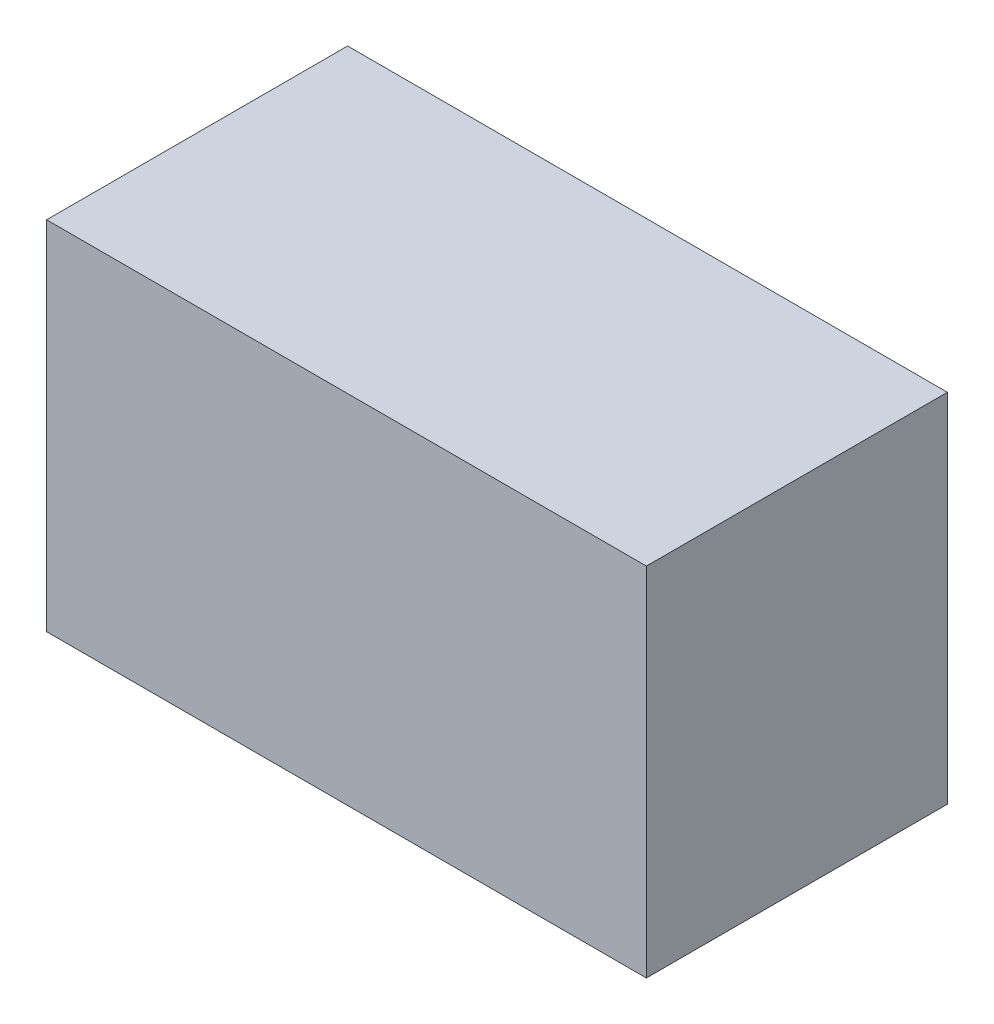
ISO-10303-21;
HEADER;
FILE_DESCRIPTION(('STEP AP214'),'2;1');
FILE_NAME('part.step','',(''),(''),'','','');
FILE_SCHEMA(('AUTOMOTIVE_DESIGN { 1 0 10303 214 1 1 1 1 }'));
ENDSEC;
DATA;
#1=APPLICATION_CONTEXT('core data for automotive mechanical design processes');
#2=APPLICATION_PROTOCOL_DEFINITION('international standard','automotive_design',2000,#1);
#3=PRODUCT_CONTEXT('',#1,'mechanical');
#4=PRODUCT('Part','Part','',(#3));
#5=PRODUCT_RELATED_PRODUCT_CATEGORY('part','',(#4));
#6=PRODUCT_DEFINITION_FORMATION('','',#4);
#7=PRODUCT_DEFINITION_CONTEXT('part definition',#1,'design');
#8=PRODUCT_DEFINITION('design','',#6,#7);
#9=PRODUCT_DEFINITION_SHAPE('','',#8);
#10=(LENGTH_UNIT() NAMED_UNIT(*) SI_UNIT(.MILLI.,.METRE.));
#11=(NAMED_UNIT(*) PLANE_ANGLE_UNIT() SI_UNIT($,.RADIAN.));
#12=(NAMED_UNIT(*) SI_UNIT($,.STERADIAN.) SOLID_ANGLE_UNIT());
#13=UNCERTAINTY_MEASURE_WITH_UNIT(LENGTH_MEASURE(1.E-05),#10,'distance_accuracy_value','');
#14=(GEOMETRIC_REPRESENTATION_CONTEXT(3) GLOBAL_UNCERTAINTY_ASSIGNED_CONTEXT((#13)) GLOBAL_UNIT_ASSIGNED_CONTEXT((#10,
#11,#12)) REPRESENTATION_CONTEXT('',''));
#15=CARTESIAN_POINT('',(0.,0.,0.));
#16=DIRECTION('',(0.,0.,1.));
#17=DIRECTION('',(1.,0.,0.));
#18=AXIS2_PLACEMENT_3D('',#15,#16,#17);
#19=CARTESIAN_POINT('',(-1.34500393883586,0.799989165164845,0.));
#20=DIRECTION('',(-1.,1.19248806385031E-08,0.));
#21=DIRECTION('',(-1.19248806385031E-08,-1.,0.));
#22=AXIS2_PLACEMENT_3D('',#19,#20,#21);
#23=PLANE('',#22);
#24=DIRECTION('',(-1.19248806876995E-08,-1.,0.));
#25=VECTOR('',#24,1.);
#26=CARTESIAN_POINT('',(-1.34500393883586,0.799989165164845,0.));
#27=LINE('',#26,#25);
#28=CARTESIAN_POINT('',(-1.34500393883586,0.799989165164845,0.));
#29=VERTEX_POINT('',#28);
#30=CARTESIAN_POINT('',(-1.34500395791538,-0.799986420772655,0.));
#31=VERTEX_POINT('',#30);
#32=EDGE_CURVE('E11',#29,#31,#27,.T.);
#33=ORIENTED_EDGE('',*,*,#32,.T.);
#34=DIRECTION('',(0.,0.,1.));
#35=VECTOR('',#34,1.);
#36=CARTESIAN_POINT('',(-1.34500395791538,-0.799986420772655,0.));
#37=LINE('',#36,#35);
#38=CARTESIAN_POINT('',(-1.34500395791538,-0.799986420772655,1.34999978542328));
#39=VERTEX_POINT('',#38);
#40=EDGE_CURVE('E88',#31,#39,#37,.T.);
#41=ORIENTED_EDGE('',*,*,#40,.T.);
#42=DIRECTION('',(-1.19248806876995E-08,-1.,0.));
#43=VECTOR('',#42,1.);
#44=CARTESIAN_POINT('',(-1.34500393883586,0.799989165164845,1.34999978542328));
#45=LINE('',#44,#43);
#46=CARTESIAN_POINT('',(-1.34500393883586,0.799989165164845,1.34999978542328));
#47=VERTEX_POINT('',#46);
#48=EDGE_CURVE('E83',#47,#39,#45,.T.);
#49=ORIENTED_EDGE('',*,*,#48,.F.);
#50=DIRECTION('',(0.,0.,1.));
#51=VECTOR('',#50,1.);
#52=CARTESIAN_POINT('',(-1.34500393883586,0.799989165164869,0.));
#53=LINE('',#52,#51);
#54=EDGE_CURVE('E72',#29,#47,#53,.T.);
#55=ORIENTED_EDGE('',*,*,#54,.F.);
#56=EDGE_LOOP('',(#33,#41,#49,#55));
#57=FACE_BOUND('',#56,.T.);
#58=ADVANCED_FACE('F17',(#57),#23,.T.);
#59=CARTESIAN_POINT('',(-1.34500395791538,-0.799986420772655,0.));
#60=DIRECTION('',(-1.19248806385031E-08,-1.,0.));
#61=DIRECTION('',(1.,-1.19248806385031E-08,0.));
#62=AXIS2_PLACEMENT_3D('',#59,#60,#61);
#63=PLANE('',#62);
#64=DIRECTION('',(1.,-1.19248806520858E-08,0.));
#65=VECTOR('',#64,1.);
#66=CARTESIAN_POINT('',(-1.34500395791538,-0.799986420772655,0.));
#67=LINE('',#66,#65);
#68=CARTESIAN_POINT('',(1.34499848349087,-0.79998645285059,0.));
#69=VERTEX_POINT('',#68);
#70=EDGE_CURVE('E24',#31,#69,#67,.T.);
#71=ORIENTED_EDGE('',*,*,#70,.T.);
#72=DIRECTION('',(0.,0.,1.));
#73=VECTOR('',#72,1.);
#74=CARTESIAN_POINT('',(1.34499848349087,-0.799986452850613,0.));
#75=LINE('',#74,#73);
#76=CARTESIAN_POINT('',(1.34499848349087,-0.79998645285059,1.34999978542328));
#77=VERTEX_POINT('',#76);
#78=EDGE_CURVE('E85',#69,#77,#75,.T.);
#79=ORIENTED_EDGE('',*,*,#78,.T.);
#80=DIRECTION('',(1.,-1.19248806520858E-08,0.));
#81=VECTOR('',#80,1.);
#82=CARTESIAN_POINT('',(-1.34500395791538,-0.799986420772655,1.34999978542328));
#83=LINE('',#82,#81);
#84=EDGE_CURVE('E66',#39,#77,#83,.T.);
#85=ORIENTED_EDGE('',*,*,#84,.F.);
#86=ORIENTED_EDGE('',*,*,#40,.F.);
#87=EDGE_LOOP('',(#71,#79,#85,#86));
#88=FACE_BOUND('',#87,.T.);
#89=ADVANCED_FACE('F89',(#88),#63,.T.);
#90=CARTESIAN_POINT('',(1.34499848349087,-0.79998645285059,0.));
#91=DIRECTION('',(1.,-1.19248806385031E-08,0.));
#92=DIRECTION('',(1.19248806385031E-08,1.,0.));
#93=AXIS2_PLACEMENT_3D('',#90,#91,#92);
#94=PLANE('',#93);
#95=DIRECTION('',(1.19248806876995E-08,1.,0.));
#96=VECTOR('',#95,1.);
#97=CARTESIAN_POINT('',(1.34499848349087,-0.79998645285059,0.));
#98=LINE('',#97,#96);
#99=CARTESIAN_POINT('',(1.34499850257039,0.79998913308691,0.));
#100=VERTEX_POINT('',#99);
#101=EDGE_CURVE('E62',#69,#100,#98,.T.);
#102=ORIENTED_EDGE('',*,*,#101,.T.);
#103=DIRECTION('',(0.,0.,1.));
#104=VECTOR('',#103,1.);
#105=CARTESIAN_POINT('',(1.34499850257039,0.79998913308691,0.));
#106=LINE('',#105,#104);
#107=CARTESIAN_POINT('',(1.34499850257039,0.79998913308691,1.34999978542328));
#108=VERTEX_POINT('',#107);
#109=EDGE_CURVE('E55',#100,#108,#106,.T.);
#110=ORIENTED_EDGE('',*,*,#109,.T.);
#111=DIRECTION('',(1.19248806876995E-08,1.,0.));
#112=VECTOR('',#111,1.);
#113=CARTESIAN_POINT('',(1.34499848349087,-0.79998645285059,1.34999978542328));
#114=LINE('',#113,#112);
#115=EDGE_CURVE('E59',#77,#108,#114,.T.);
#116=ORIENTED_EDGE('',*,*,#115,.F.);
#117=ORIENTED_EDGE('',*,*,#78,.F.);
#118=EDGE_LOOP('',(#102,#110,#116,#117));
#119=FACE_BOUND('',#118,.T.);
#120=ADVANCED_FACE('F57',(#119),#94,.T.);
#121=CARTESIAN_POINT('',(1.34499850257039,0.79998913308691,0.));
#122=DIRECTION('',(1.19248806385031E-08,1.,0.));
#123=DIRECTION('',(-1.,1.19248806385031E-08,0.));
#124=AXIS2_PLACEMENT_3D('',#121,#122,#123);
#125=PLANE('',#124);
#126=DIRECTION('',(-1.,1.19248806520858E-08,0.));
#127=VECTOR('',#126,1.);
#128=CARTESIAN_POINT('',(1.34499850257039,0.79998913308691,0.));
#129=LINE('',#128,#127);
#130=EDGE_CURVE('E65',#100,#29,#129,.T.);
#131=ORIENTED_EDGE('',*,*,#130,.T.);
#132=ORIENTED_EDGE('',*,*,#54,.T.);
#133=DIRECTION('',(-1.,1.19248806520858E-08,0.));
#134=VECTOR('',#133,1.);
#135=CARTESIAN_POINT('',(1.34499850257039,0.79998913308691,1.34999978542328));
#136=LINE('',#135,#134);
#137=EDGE_CURVE('E70',#108,#47,#136,.T.);
#138=ORIENTED_EDGE('',*,*,#137,.F.);
#139=ORIENTED_EDGE('',*,*,#109,.F.);
#140=EDGE_LOOP('',(#131,#132,#138,#139));
#141=FACE_BOUND('',#140,.T.);
#142=ADVANCED_FACE('F71',(#141),#125,.T.);
#143=CARTESIAN_POINT('',(113.724998474121,-411.049987792969,1.34999978542328));
#144=DIRECTION('',(0.,0.,1.));
#145=DIRECTION('',(1.19248806385031E-08,1.,0.));
#146=AXIS2_PLACEMENT_3D('',#143,#144,#145);
#147=PLANE('',#146);
#148=ORIENTED_EDGE('',*,*,#48,.T.);
#149=ORIENTED_EDGE('',*,*,#84,.T.);
#150=ORIENTED_EDGE('',*,*,#115,.T.);
#151=ORIENTED_EDGE('',*,*,#137,.T.);
#152=EDGE_LOOP('',(#148,#149,#150,#151));
#153=FACE_BOUND('',#152,.T.);
#154=ADVANCED_FACE('F76',(#153),#147,.T.);
#155=CARTESIAN_POINT('',(113.724998474121,-411.049987792969,0.));
#156=DIRECTION('',(0.,0.,1.));
#157=DIRECTION('',(1.19248806385031E-08,1.,0.));
#158=AXIS2_PLACEMENT_3D('',#155,#156,#157);
#159=PLANE('',#158);
#160=ORIENTED_EDGE('',*,*,#130,.F.);
#161=ORIENTED_EDGE('',*,*,#101,.F.);
#162=ORIENTED_EDGE('',*,*,#70,.F.);
#163=ORIENTED_EDGE('',*,*,#32,.F.);
#164=EDGE_LOOP('',(#160,#161,#162,#163));
#165=FACE_BOUND('',#164,.T.);
#166=ADVANCED_FACE('F91',(#165),#159,.F.);
#167=CLOSED_SHELL('',(#58,#89,#120,#142,#154,#166));
#168=MANIFOLD_SOLID_BREP('B1',#167);
#169=ADVANCED_BREP_SHAPE_REPRESENTATION('',(#18,#168),#14);
#170=SHAPE_DEFINITION_REPRESENTATION(#9,#169);
ENDSEC;
END-ISO-10303-21;
